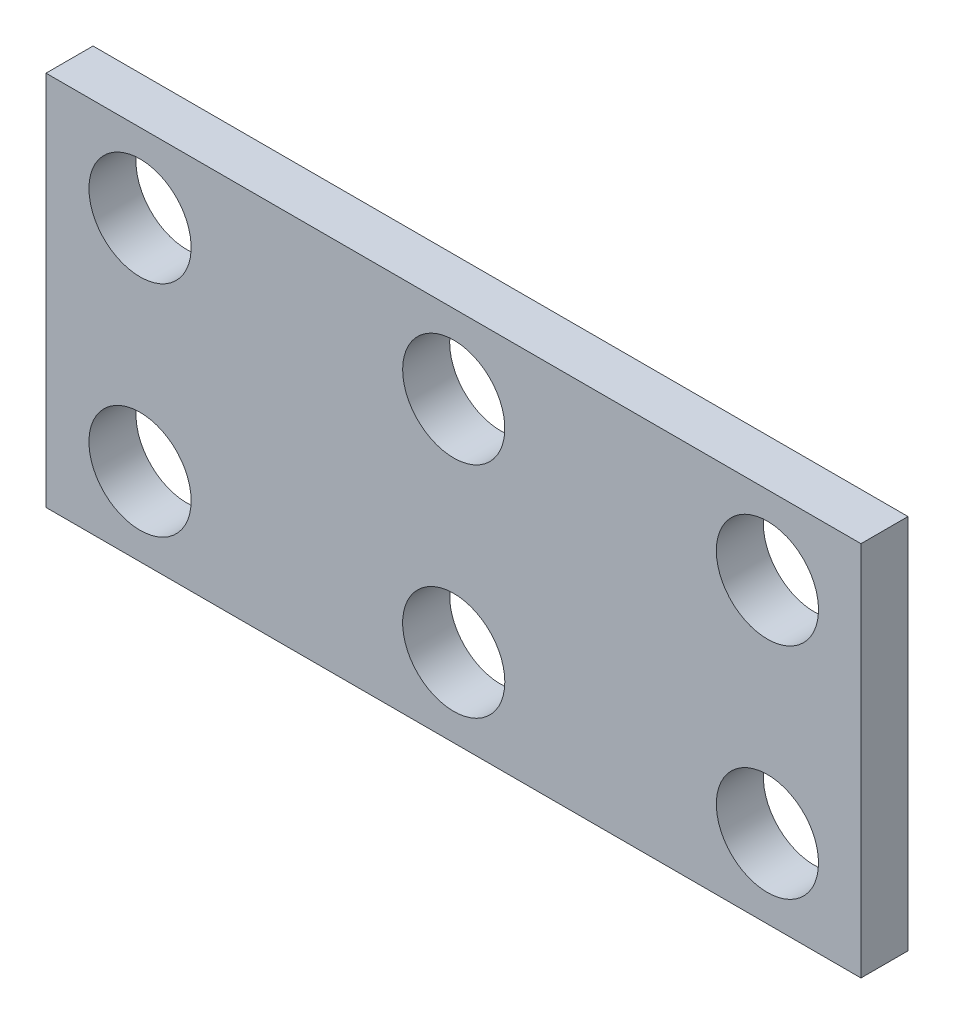
ISO-10303-21;
HEADER;
FILE_DESCRIPTION(('STEP AP214'),'2;1');
FILE_NAME('part.step','',(''),(''),'','','');
FILE_SCHEMA(('AUTOMOTIVE_DESIGN { 1 0 10303 214 1 1 1 1 }'));
ENDSEC;
DATA;
#1=APPLICATION_CONTEXT('core data for automotive mechanical design processes');
#2=APPLICATION_PROTOCOL_DEFINITION('international standard','automotive_design',2000,#1);
#3=PRODUCT_CONTEXT('',#1,'mechanical');
#4=PRODUCT('Part','Part','',(#3));
#5=PRODUCT_RELATED_PRODUCT_CATEGORY('part','',(#4));
#6=PRODUCT_DEFINITION_FORMATION('','',#4);
#7=PRODUCT_DEFINITION_CONTEXT('part definition',#1,'design');
#8=PRODUCT_DEFINITION('design','',#6,#7);
#9=PRODUCT_DEFINITION_SHAPE('','',#8);
#10=(LENGTH_UNIT() NAMED_UNIT(*) SI_UNIT(.MILLI.,.METRE.));
#11=(NAMED_UNIT(*) PLANE_ANGLE_UNIT() SI_UNIT($,.RADIAN.));
#12=(NAMED_UNIT(*) SI_UNIT($,.STERADIAN.) SOLID_ANGLE_UNIT());
#13=UNCERTAINTY_MEASURE_WITH_UNIT(LENGTH_MEASURE(1.E-05),#10,'distance_accuracy_value','');
#14=(GEOMETRIC_REPRESENTATION_CONTEXT(3) GLOBAL_UNCERTAINTY_ASSIGNED_CONTEXT((#13)) GLOBAL_UNIT_ASSIGNED_CONTEXT((#10,
#11,#12)) REPRESENTATION_CONTEXT('',''));
#15=CARTESIAN_POINT('',(0.,0.,0.));
#16=DIRECTION('',(0.,0.,1.));
#17=DIRECTION('',(1.,0.,0.));
#18=AXIS2_PLACEMENT_3D('',#15,#16,#17);
#19=CARTESIAN_POINT('',(0.,0.,-1.5));
#20=DIRECTION('',(1.,0.,0.));
#21=DIRECTION('',(0.,0.,-1.));
#22=AXIS2_PLACEMENT_3D('',#19,#20,#21);
#23=PLANE('',#22);
#24=DIRECTION('',(0.,1.,0.));
#25=VECTOR('',#24,1.);
#26=CARTESIAN_POINT('',(0.,0.,0.));
#27=LINE('',#26,#25);
#28=CARTESIAN_POINT('',(0.,0.,0.));
#29=VERTEX_POINT('',#28);
#30=CARTESIAN_POINT('',(0.,12.,0.));
#31=VERTEX_POINT('',#30);
#32=EDGE_CURVE('E98',#29,#31,#27,.T.);
#33=ORIENTED_EDGE('',*,*,#32,.F.);
#34=DIRECTION('',(0.,0.,1.));
#35=VECTOR('',#34,1.);
#36=CARTESIAN_POINT('',(0.,0.,-1.5));
#37=LINE('',#36,#35);
#38=CARTESIAN_POINT('',(0.,0.,-1.5));
#39=VERTEX_POINT('',#38);
#40=EDGE_CURVE('E11',#39,#29,#37,.T.);
#41=ORIENTED_EDGE('',*,*,#40,.F.);
#42=DIRECTION('',(0.,1.,0.));
#43=VECTOR('',#42,1.);
#44=CARTESIAN_POINT('',(0.,0.,-1.5));
#45=LINE('',#44,#43);
#46=CARTESIAN_POINT('',(0.,12.,-1.5));
#47=VERTEX_POINT('',#46);
#48=EDGE_CURVE('E91',#39,#47,#45,.T.);
#49=ORIENTED_EDGE('',*,*,#48,.T.);
#50=DIRECTION('',(0.,0.,1.));
#51=VECTOR('',#50,1.);
#52=CARTESIAN_POINT('',(0.,12.,-1.5));
#53=LINE('',#52,#51);
#54=EDGE_CURVE('E36',#47,#31,#53,.T.);
#55=ORIENTED_EDGE('',*,*,#54,.T.);
#56=EDGE_LOOP('',(#33,#41,#49,#55));
#57=FACE_BOUND('',#56,.T.);
#58=ADVANCED_FACE('F33',(#57),#23,.T.);
#59=CARTESIAN_POINT('',(0.,0.,-1.5));
#60=DIRECTION('',(0.,-1.,0.));
#61=DIRECTION('',(1.,0.,0.));
#62=AXIS2_PLACEMENT_3D('',#59,#60,#61);
#63=PLANE('',#62);
#64=DIRECTION('',(1.,0.,0.));
#65=VECTOR('',#64,1.);
#66=CARTESIAN_POINT('',(0.,0.,0.));
#67=LINE('',#66,#65);
#68=CARTESIAN_POINT('',(-26.,0.,0.));
#69=VERTEX_POINT('',#68);
#70=EDGE_CURVE('E93',#69,#29,#67,.T.);
#71=ORIENTED_EDGE('',*,*,#70,.F.);
#72=DIRECTION('',(0.,0.,1.));
#73=VECTOR('',#72,1.);
#74=CARTESIAN_POINT('',(-26.,0.,-1.5));
#75=LINE('',#74,#73);
#76=CARTESIAN_POINT('',(-26.,0.,-1.5));
#77=VERTEX_POINT('',#76);
#78=EDGE_CURVE('E42',#77,#69,#75,.T.);
#79=ORIENTED_EDGE('',*,*,#78,.F.);
#80=DIRECTION('',(1.,0.,0.));
#81=VECTOR('',#80,1.);
#82=CARTESIAN_POINT('',(0.,0.,-1.5));
#83=LINE('',#82,#81);
#84=EDGE_CURVE('E88',#77,#39,#83,.T.);
#85=ORIENTED_EDGE('',*,*,#84,.T.);
#86=ORIENTED_EDGE('',*,*,#40,.T.);
#87=EDGE_LOOP('',(#71,#79,#85,#86));
#88=FACE_BOUND('',#87,.T.);
#89=ADVANCED_FACE('F109',(#88),#63,.T.);
#90=CARTESIAN_POINT('',(-26.,0.,-1.5));
#91=DIRECTION('',(-1.,0.,0.));
#92=DIRECTION('',(0.,0.,1.));
#93=AXIS2_PLACEMENT_3D('',#90,#91,#92);
#94=PLANE('',#93);
#95=DIRECTION('',(0.,-1.,0.));
#96=VECTOR('',#95,1.);
#97=CARTESIAN_POINT('',(-26.,0.,0.));
#98=LINE('',#97,#96);
#99=CARTESIAN_POINT('',(-26.,12.,0.));
#100=VERTEX_POINT('',#99);
#101=EDGE_CURVE('E83',#100,#69,#98,.T.);
#102=ORIENTED_EDGE('',*,*,#101,.F.);
#103=DIRECTION('',(0.,0.,1.));
#104=VECTOR('',#103,1.);
#105=CARTESIAN_POINT('',(-26.,12.,-1.5));
#106=LINE('',#105,#104);
#107=CARTESIAN_POINT('',(-26.,12.,-1.5));
#108=VERTEX_POINT('',#107);
#109=EDGE_CURVE('E78',#108,#100,#106,.T.);
#110=ORIENTED_EDGE('',*,*,#109,.F.);
#111=DIRECTION('',(0.,-1.,0.));
#112=VECTOR('',#111,1.);
#113=CARTESIAN_POINT('',(-26.,0.,-1.5));
#114=LINE('',#113,#112);
#115=EDGE_CURVE('E81',#108,#77,#114,.T.);
#116=ORIENTED_EDGE('',*,*,#115,.T.);
#117=ORIENTED_EDGE('',*,*,#78,.T.);
#118=EDGE_LOOP('',(#102,#110,#116,#117));
#119=FACE_BOUND('',#118,.T.);
#120=ADVANCED_FACE('F80',(#119),#94,.T.);
#121=CARTESIAN_POINT('',(0.,12.,-1.5));
#122=DIRECTION('',(0.,1.,0.));
#123=DIRECTION('',(-1.,0.,0.));
#124=AXIS2_PLACEMENT_3D('',#121,#122,#123);
#125=PLANE('',#124);
#126=DIRECTION('',(-1.,0.,0.));
#127=VECTOR('',#126,1.);
#128=CARTESIAN_POINT('',(0.,12.,0.));
#129=LINE('',#128,#127);
#130=EDGE_CURVE('E101',#31,#100,#129,.T.);
#131=ORIENTED_EDGE('',*,*,#130,.F.);
#132=ORIENTED_EDGE('',*,*,#54,.F.);
#133=DIRECTION('',(-1.,0.,0.));
#134=VECTOR('',#133,1.);
#135=CARTESIAN_POINT('',(0.,12.,-1.5));
#136=LINE('',#135,#134);
#137=EDGE_CURVE('E87',#47,#108,#136,.T.);
#138=ORIENTED_EDGE('',*,*,#137,.T.);
#139=ORIENTED_EDGE('',*,*,#109,.T.);
#140=EDGE_LOOP('',(#131,#132,#138,#139));
#141=FACE_BOUND('',#140,.T.);
#142=ADVANCED_FACE('F90',(#141),#125,.T.);
#143=CARTESIAN_POINT('',(0.,12.,-1.5));
#144=DIRECTION('',(0.,0.,1.));
#145=DIRECTION('',(1.,0.,0.));
#146=AXIS2_PLACEMENT_3D('',#143,#144,#145);
#147=PLANE('',#146);
#148=CARTESIAN_POINT('',(-23.,9.5,-1.5));
#149=DIRECTION('',(0.,0.,1.));
#150=DIRECTION('',(-1.,0.,0.));
#151=AXIS2_PLACEMENT_3D('',#148,#149,#150);
#152=CIRCLE('',#151,1.63);
#153=CARTESIAN_POINT('',(-24.63,9.5,-1.5));
#154=VERTEX_POINT('',#153);
#155=EDGE_CURVE('E158',#154,#154,#152,.T.);
#156=ORIENTED_EDGE('',*,*,#155,.T.);
#157=EDGE_LOOP('',(#156));
#158=FACE_BOUND('',#157,.T.);
#159=CARTESIAN_POINT('',(-12.9924,9.5,-1.5));
#160=DIRECTION('',(0.,0.,1.));
#161=DIRECTION('',(-1.,0.,0.));
#162=AXIS2_PLACEMENT_3D('',#159,#160,#161);
#163=CIRCLE('',#162,1.63);
#164=CARTESIAN_POINT('',(-14.6224,9.5,-1.5));
#165=VERTEX_POINT('',#164);
#166=EDGE_CURVE('E166',#165,#165,#163,.T.);
#167=ORIENTED_EDGE('',*,*,#166,.T.);
#168=EDGE_LOOP('',(#167));
#169=FACE_BOUND('',#168,.T.);
#170=CARTESIAN_POINT('',(-2.98480000000001,9.5,-1.5));
#171=DIRECTION('',(0.,0.,1.));
#172=DIRECTION('',(-1.,0.,0.));
#173=AXIS2_PLACEMENT_3D('',#170,#171,#172);
#174=CIRCLE('',#173,1.63);
#175=CARTESIAN_POINT('',(-4.61480000000001,9.5,-1.5));
#176=VERTEX_POINT('',#175);
#177=EDGE_CURVE('E172',#176,#176,#174,.T.);
#178=ORIENTED_EDGE('',*,*,#177,.T.);
#179=EDGE_LOOP('',(#178));
#180=FACE_BOUND('',#179,.T.);
#181=CARTESIAN_POINT('',(-2.9848,2.5,-1.5));
#182=DIRECTION('',(0.,0.,1.));
#183=DIRECTION('',(1.,0.,0.));
#184=AXIS2_PLACEMENT_3D('',#181,#182,#183);
#185=CIRCLE('',#184,1.63);
#186=CARTESIAN_POINT('',(-1.3548,2.5,-1.5));
#187=VERTEX_POINT('',#186);
#188=EDGE_CURVE('E178',#187,#187,#185,.T.);
#189=ORIENTED_EDGE('',*,*,#188,.T.);
#190=EDGE_LOOP('',(#189));
#191=FACE_BOUND('',#190,.T.);
#192=CARTESIAN_POINT('',(-12.9924,2.5,-1.5));
#193=DIRECTION('',(0.,0.,1.));
#194=DIRECTION('',(1.,0.,0.));
#195=AXIS2_PLACEMENT_3D('',#192,#193,#194);
#196=CIRCLE('',#195,1.63);
#197=CARTESIAN_POINT('',(-11.3624,2.5,-1.5));
#198=VERTEX_POINT('',#197);
#199=EDGE_CURVE('E184',#198,#198,#196,.T.);
#200=ORIENTED_EDGE('',*,*,#199,.T.);
#201=EDGE_LOOP('',(#200));
#202=FACE_BOUND('',#201,.T.);
#203=CARTESIAN_POINT('',(-23.,2.5,-1.5));
#204=DIRECTION('',(0.,0.,1.));
#205=DIRECTION('',(1.,0.,0.));
#206=AXIS2_PLACEMENT_3D('',#203,#204,#205);
#207=CIRCLE('',#206,1.63);
#208=CARTESIAN_POINT('',(-21.37,2.5,-1.5));
#209=VERTEX_POINT('',#208);
#210=EDGE_CURVE('E102',#209,#209,#207,.T.);
#211=ORIENTED_EDGE('',*,*,#210,.T.);
#212=EDGE_LOOP('',(#211));
#213=FACE_BOUND('',#212,.T.);
#214=ORIENTED_EDGE('',*,*,#48,.F.);
#215=ORIENTED_EDGE('',*,*,#84,.F.);
#216=ORIENTED_EDGE('',*,*,#115,.F.);
#217=ORIENTED_EDGE('',*,*,#137,.F.);
#218=EDGE_LOOP('',(#214,#215,#216,#217));
#219=FACE_BOUND('',#218,.T.);
#220=ADVANCED_FACE('F86',(#158,#169,#180,#191,#202,#213,#219),#147,.F.);
#221=CARTESIAN_POINT('',(0.,12.,0.));
#222=DIRECTION('',(0.,0.,1.));
#223=DIRECTION('',(1.,0.,0.));
#224=AXIS2_PLACEMENT_3D('',#221,#222,#223);
#225=PLANE('',#224);
#226=CARTESIAN_POINT('',(-23.,9.5,0.));
#227=DIRECTION('',(0.,0.,1.));
#228=DIRECTION('',(-1.,0.,0.));
#229=AXIS2_PLACEMENT_3D('',#226,#227,#228);
#230=CIRCLE('',#229,1.63);
#231=CARTESIAN_POINT('',(-24.63,9.5,0.));
#232=VERTEX_POINT('',#231);
#233=EDGE_CURVE('E161',#232,#232,#230,.T.);
#234=ORIENTED_EDGE('',*,*,#233,.F.);
#235=EDGE_LOOP('',(#234));
#236=FACE_BOUND('',#235,.T.);
#237=CARTESIAN_POINT('',(-12.9924,9.5,0.));
#238=DIRECTION('',(0.,0.,1.));
#239=DIRECTION('',(-1.,0.,0.));
#240=AXIS2_PLACEMENT_3D('',#237,#238,#239);
#241=CIRCLE('',#240,1.63);
#242=CARTESIAN_POINT('',(-14.6224,9.5,0.));
#243=VERTEX_POINT('',#242);
#244=EDGE_CURVE('E163',#243,#243,#241,.T.);
#245=ORIENTED_EDGE('',*,*,#244,.F.);
#246=EDGE_LOOP('',(#245));
#247=FACE_BOUND('',#246,.T.);
#248=CARTESIAN_POINT('',(-2.98480000000001,9.5,0.));
#249=DIRECTION('',(0.,0.,1.));
#250=DIRECTION('',(-1.,0.,0.));
#251=AXIS2_PLACEMENT_3D('',#248,#249,#250);
#252=CIRCLE('',#251,1.63);
#253=CARTESIAN_POINT('',(-4.61480000000001,9.5,0.));
#254=VERTEX_POINT('',#253);
#255=EDGE_CURVE('E169',#254,#254,#252,.T.);
#256=ORIENTED_EDGE('',*,*,#255,.F.);
#257=EDGE_LOOP('',(#256));
#258=FACE_BOUND('',#257,.T.);
#259=CARTESIAN_POINT('',(-2.9848,2.5,0.));
#260=DIRECTION('',(0.,0.,1.));
#261=DIRECTION('',(1.,0.,0.));
#262=AXIS2_PLACEMENT_3D('',#259,#260,#261);
#263=CIRCLE('',#262,1.63);
#264=CARTESIAN_POINT('',(-1.3548,2.5,0.));
#265=VERTEX_POINT('',#264);
#266=EDGE_CURVE('E175',#265,#265,#263,.T.);
#267=ORIENTED_EDGE('',*,*,#266,.F.);
#268=EDGE_LOOP('',(#267));
#269=FACE_BOUND('',#268,.T.);
#270=CARTESIAN_POINT('',(-12.9924,2.5,0.));
#271=DIRECTION('',(0.,0.,1.));
#272=DIRECTION('',(1.,0.,0.));
#273=AXIS2_PLACEMENT_3D('',#270,#271,#272);
#274=CIRCLE('',#273,1.63);
#275=CARTESIAN_POINT('',(-11.3624,2.5,0.));
#276=VERTEX_POINT('',#275);
#277=EDGE_CURVE('E181',#276,#276,#274,.T.);
#278=ORIENTED_EDGE('',*,*,#277,.F.);
#279=EDGE_LOOP('',(#278));
#280=FACE_BOUND('',#279,.T.);
#281=CARTESIAN_POINT('',(-23.,2.5,0.));
#282=DIRECTION('',(0.,0.,1.));
#283=DIRECTION('',(1.,0.,0.));
#284=AXIS2_PLACEMENT_3D('',#281,#282,#283);
#285=CIRCLE('',#284,1.63);
#286=CARTESIAN_POINT('',(-21.37,2.5,0.));
#287=VERTEX_POINT('',#286);
#288=EDGE_CURVE('E187',#287,#287,#285,.T.);
#289=ORIENTED_EDGE('',*,*,#288,.F.);
#290=EDGE_LOOP('',(#289));
#291=FACE_BOUND('',#290,.T.);
#292=ORIENTED_EDGE('',*,*,#32,.T.);
#293=ORIENTED_EDGE('',*,*,#130,.T.);
#294=ORIENTED_EDGE('',*,*,#101,.T.);
#295=ORIENTED_EDGE('',*,*,#70,.T.);
#296=EDGE_LOOP('',(#292,#293,#294,#295));
#297=FACE_BOUND('',#296,.T.);
#298=ADVANCED_FACE('F108',(#236,#247,#258,#269,#280,#291,#297),#225,.T.);
#299=CARTESIAN_POINT('',(-23.,2.5,-1.5));
#300=DIRECTION('',(0.,0.,1.));
#301=DIRECTION('',(1.,0.,0.));
#302=AXIS2_PLACEMENT_3D('',#299,#300,#301);
#303=CYLINDRICAL_SURFACE('',#302,1.63);
#304=ORIENTED_EDGE('',*,*,#210,.F.);
#305=EDGE_LOOP('',(#304));
#306=FACE_BOUND('',#305,.T.);
#307=ORIENTED_EDGE('',*,*,#288,.T.);
#308=EDGE_LOOP('',(#307));
#309=FACE_BOUND('',#308,.T.);
#310=ADVANCED_FACE('F127',(#306,#309),#303,.F.);
#311=CARTESIAN_POINT('',(-12.9924,2.5,-1.5));
#312=DIRECTION('',(0.,0.,1.));
#313=DIRECTION('',(1.,0.,0.));
#314=AXIS2_PLACEMENT_3D('',#311,#312,#313);
#315=CYLINDRICAL_SURFACE('',#314,1.63);
#316=ORIENTED_EDGE('',*,*,#199,.F.);
#317=EDGE_LOOP('',(#316));
#318=FACE_BOUND('',#317,.T.);
#319=ORIENTED_EDGE('',*,*,#277,.T.);
#320=EDGE_LOOP('',(#319));
#321=FACE_BOUND('',#320,.T.);
#322=ADVANCED_FACE('F134',(#318,#321),#315,.F.);
#323=CARTESIAN_POINT('',(-2.9848,2.5,-1.5));
#324=DIRECTION('',(0.,0.,1.));
#325=DIRECTION('',(1.,0.,0.));
#326=AXIS2_PLACEMENT_3D('',#323,#324,#325);
#327=CYLINDRICAL_SURFACE('',#326,1.63);
#328=ORIENTED_EDGE('',*,*,#188,.F.);
#329=EDGE_LOOP('',(#328));
#330=FACE_BOUND('',#329,.T.);
#331=ORIENTED_EDGE('',*,*,#266,.T.);
#332=EDGE_LOOP('',(#331));
#333=FACE_BOUND('',#332,.T.);
#334=ADVANCED_FACE('F138',(#330,#333),#327,.F.);
#335=CARTESIAN_POINT('',(-2.98480000000001,9.5,-1.5));
#336=DIRECTION('',(0.,0.,1.));
#337=DIRECTION('',(1.,0.,0.));
#338=AXIS2_PLACEMENT_3D('',#335,#336,#337);
#339=CYLINDRICAL_SURFACE('',#338,1.63);
#340=ORIENTED_EDGE('',*,*,#177,.F.);
#341=EDGE_LOOP('',(#340));
#342=FACE_BOUND('',#341,.T.);
#343=ORIENTED_EDGE('',*,*,#255,.T.);
#344=EDGE_LOOP('',(#343));
#345=FACE_BOUND('',#344,.T.);
#346=ADVANCED_FACE('F142',(#342,#345),#339,.F.);
#347=CARTESIAN_POINT('',(-12.9924,9.5,-1.5));
#348=DIRECTION('',(0.,0.,1.));
#349=DIRECTION('',(1.,0.,0.));
#350=AXIS2_PLACEMENT_3D('',#347,#348,#349);
#351=CYLINDRICAL_SURFACE('',#350,1.63);
#352=ORIENTED_EDGE('',*,*,#166,.F.);
#353=EDGE_LOOP('',(#352));
#354=FACE_BOUND('',#353,.T.);
#355=ORIENTED_EDGE('',*,*,#244,.T.);
#356=EDGE_LOOP('',(#355));
#357=FACE_BOUND('',#356,.T.);
#358=ADVANCED_FACE('F146',(#354,#357),#351,.F.);
#359=CARTESIAN_POINT('',(-23.,9.5,-1.5));
#360=DIRECTION('',(0.,0.,1.));
#361=DIRECTION('',(1.,0.,0.));
#362=AXIS2_PLACEMENT_3D('',#359,#360,#361);
#363=CYLINDRICAL_SURFACE('',#362,1.63);
#364=ORIENTED_EDGE('',*,*,#155,.F.);
#365=EDGE_LOOP('',(#364));
#366=FACE_BOUND('',#365,.T.);
#367=ORIENTED_EDGE('',*,*,#233,.T.);
#368=EDGE_LOOP('',(#367));
#369=FACE_BOUND('',#368,.T.);
#370=ADVANCED_FACE('F150',(#366,#369),#363,.F.);
#371=CLOSED_SHELL('',(#58,#89,#120,#142,#220,#298,#310,#322,#334,#346,#358,#370));
#372=MANIFOLD_SOLID_BREP('B2',#371);
#373=ADVANCED_BREP_SHAPE_REPRESENTATION('',(#18,#372),#14);
#374=SHAPE_DEFINITION_REPRESENTATION(#9,#373);
ENDSEC;
END-ISO-10303-21;
